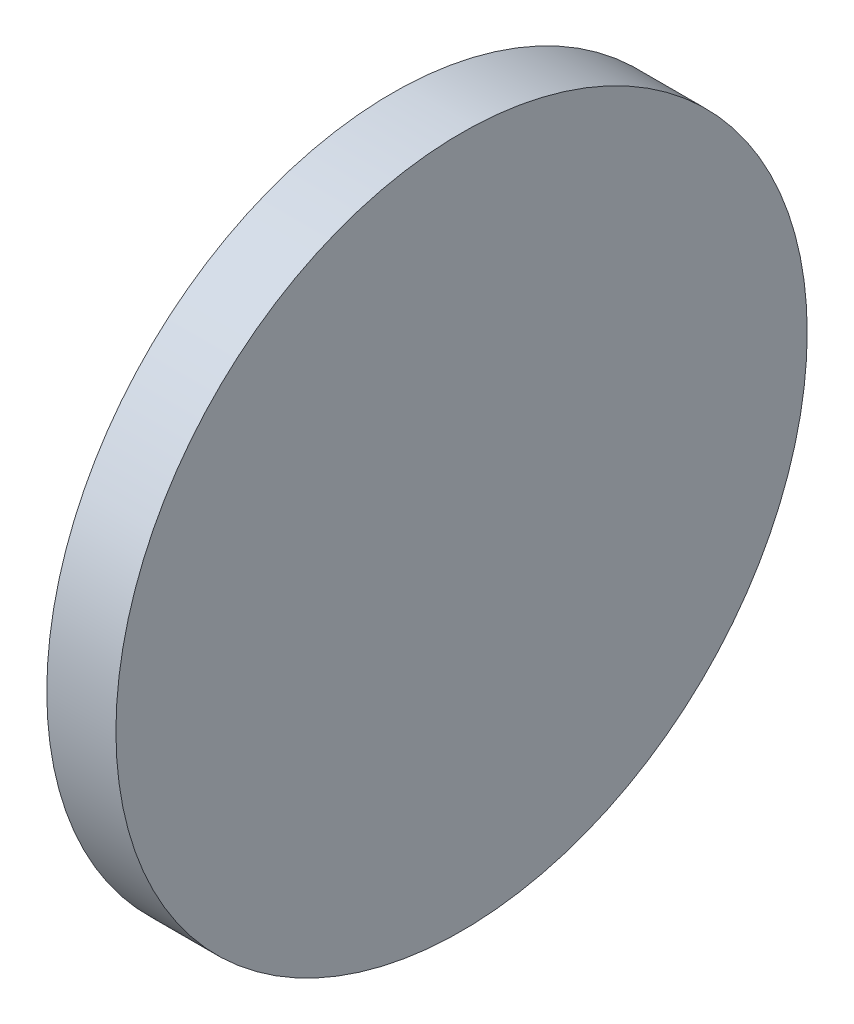
ISO-10303-21;
HEADER;
FILE_DESCRIPTION(('STEP AP214'),'2;1');
FILE_NAME('part.step','',(''),(''),'','','');
FILE_SCHEMA(('AUTOMOTIVE_DESIGN { 1 0 10303 214 1 1 1 1 }'));
ENDSEC;
DATA;
#1=APPLICATION_CONTEXT('core data for automotive mechanical design processes');
#2=APPLICATION_PROTOCOL_DEFINITION('international standard','automotive_design',2000,#1);
#3=PRODUCT_CONTEXT('',#1,'mechanical');
#4=PRODUCT('Part','Part','',(#3));
#5=PRODUCT_RELATED_PRODUCT_CATEGORY('part','',(#4));
#6=PRODUCT_DEFINITION_FORMATION('','',#4);
#7=PRODUCT_DEFINITION_CONTEXT('part definition',#1,'design');
#8=PRODUCT_DEFINITION('design','',#6,#7);
#9=PRODUCT_DEFINITION_SHAPE('','',#8);
#10=(LENGTH_UNIT() NAMED_UNIT(*) SI_UNIT(.MILLI.,.METRE.));
#11=(NAMED_UNIT(*) PLANE_ANGLE_UNIT() SI_UNIT($,.RADIAN.));
#12=(NAMED_UNIT(*) SI_UNIT($,.STERADIAN.) SOLID_ANGLE_UNIT());
#13=UNCERTAINTY_MEASURE_WITH_UNIT(LENGTH_MEASURE(1.E-05),#10,'distance_accuracy_value','');
#14=(GEOMETRIC_REPRESENTATION_CONTEXT(3) GLOBAL_UNCERTAINTY_ASSIGNED_CONTEXT((#13)) GLOBAL_UNIT_ASSIGNED_CONTEXT((#10,
#11,#12)) REPRESENTATION_CONTEXT('',''));
#15=CARTESIAN_POINT('',(0.,0.,0.));
#16=DIRECTION('',(0.,0.,1.));
#17=DIRECTION('',(1.,0.,0.));
#18=AXIS2_PLACEMENT_3D('',#15,#16,#17);
#19=CARTESIAN_POINT('',(175.418664706508,51.5287862326718,0.));
#20=DIRECTION('',(-1.,0.,0.));
#21=DIRECTION('',(0.,0.,1.));
#22=AXIS2_PLACEMENT_3D('',#19,#20,#21);
#23=PLANE('',#22);
#24=CARTESIAN_POINT('',(175.418664706508,51.5287862326718,0.));
#25=DIRECTION('',(-1.,0.,0.));
#26=DIRECTION('',(0.,0.,1.));
#27=AXIS2_PLACEMENT_3D('',#24,#25,#26);
#28=CIRCLE('',#27,9.999999999999);
#29=CARTESIAN_POINT('',(175.418664706508,51.5287862326718,9.999999999999));
#30=VERTEX_POINT('',#29);
#31=EDGE_CURVE('E10',#30,#30,#28,.T.);
#32=ORIENTED_EDGE('',*,*,#31,.F.);
#33=EDGE_LOOP('',(#32));
#34=FACE_BOUND('',#33,.T.);
#35=ADVANCED_FACE('F35',(#34),#23,.F.);
#36=CARTESIAN_POINT('',(169.33386799506,51.5287862326718,0.));
#37=DIRECTION('',(-1.,0.,0.));
#38=DIRECTION('',(0.,0.,1.));
#39=AXIS2_PLACEMENT_3D('',#36,#37,#38);
#40=CYLINDRICAL_SURFACE('',#39,9.999999999999);
#41=CARTESIAN_POINT('',(173.418664706508,51.5287862326718,0.));
#42=DIRECTION('',(-1.,0.,0.));
#43=DIRECTION('',(0.,0.,1.));
#44=AXIS2_PLACEMENT_3D('',#41,#42,#43);
#45=CIRCLE('',#44,9.999999999999);
#46=CARTESIAN_POINT('',(173.418664706508,51.5287862326718,9.999999999999));
#47=VERTEX_POINT('',#46);
#48=EDGE_CURVE('E41',#47,#47,#45,.T.);
#49=ORIENTED_EDGE('',*,*,#48,.F.);
#50=EDGE_LOOP('',(#49));
#51=FACE_BOUND('',#50,.T.);
#52=ORIENTED_EDGE('',*,*,#31,.T.);
#53=EDGE_LOOP('',(#52));
#54=FACE_BOUND('',#53,.T.);
#55=ADVANCED_FACE('F49',(#51,#54),#40,.T.);
#56=CARTESIAN_POINT('',(173.418664706508,51.5287862326718,0.));
#57=DIRECTION('',(1.,0.,0.));
#58=DIRECTION('',(0.,0.,-1.));
#59=AXIS2_PLACEMENT_3D('',#56,#57,#58);
#60=PLANE('',#59);
#61=ORIENTED_EDGE('',*,*,#48,.T.);
#62=EDGE_LOOP('',(#61));
#63=FACE_BOUND('',#62,.T.);
#64=ADVANCED_FACE('F47',(#63),#60,.F.);
#65=CLOSED_SHELL('',(#35,#55,#64));
#66=MANIFOLD_SOLID_BREP('B2',#65);
#67=ADVANCED_BREP_SHAPE_REPRESENTATION('',(#18,#66),#14);
#68=SHAPE_DEFINITION_REPRESENTATION(#9,#67);
ENDSEC;
END-ISO-10303-21;
